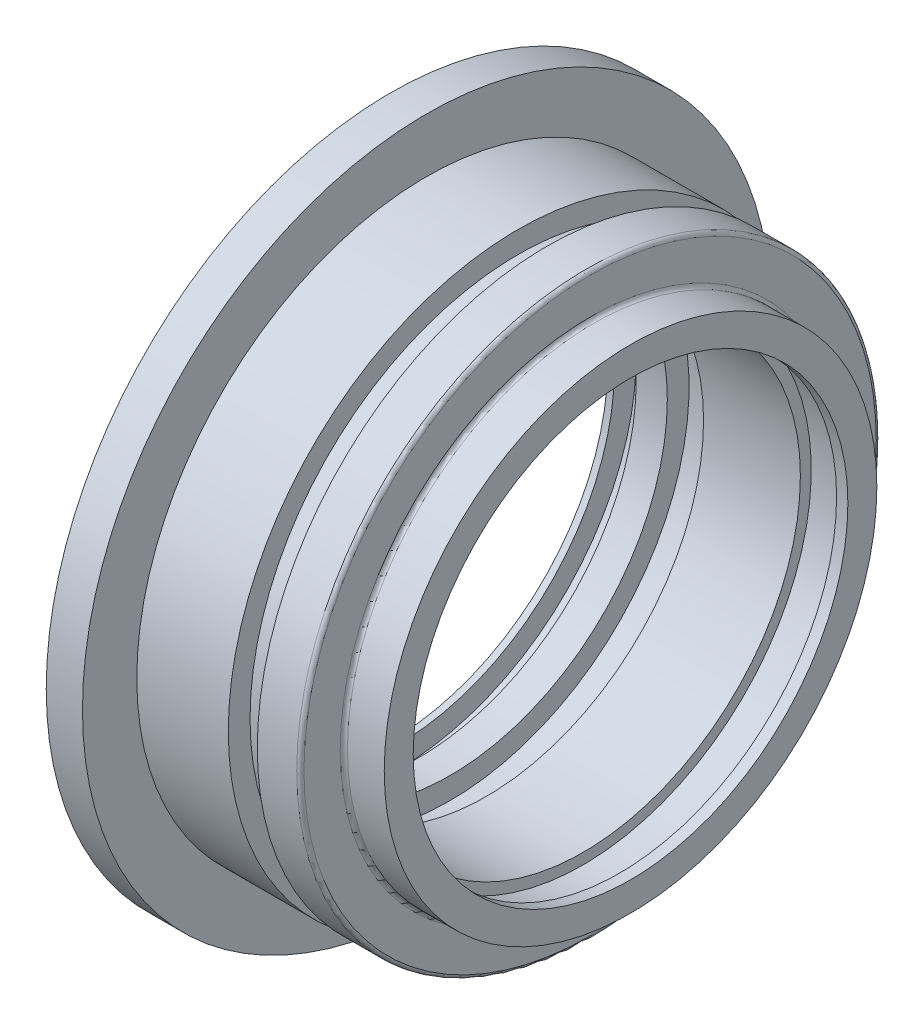
ISO-10303-21;
HEADER;
FILE_DESCRIPTION(('STEP AP214'),'2;1');
FILE_NAME('part.step','',(''),(''),'','','');
FILE_SCHEMA(('AUTOMOTIVE_DESIGN { 1 0 10303 214 1 1 1 1 }'));
ENDSEC;
DATA;
#1=APPLICATION_CONTEXT('core data for automotive mechanical design processes');
#2=APPLICATION_PROTOCOL_DEFINITION('international standard','automotive_design',2000,#1);
#3=PRODUCT_CONTEXT('',#1,'mechanical');
#4=PRODUCT('Part','Part','',(#3));
#5=PRODUCT_RELATED_PRODUCT_CATEGORY('part','',(#4));
#6=PRODUCT_DEFINITION_FORMATION('','',#4);
#7=PRODUCT_DEFINITION_CONTEXT('part definition',#1,'design');
#8=PRODUCT_DEFINITION('design','',#6,#7);
#9=PRODUCT_DEFINITION_SHAPE('','',#8);
#10=(LENGTH_UNIT() NAMED_UNIT(*) SI_UNIT(.MILLI.,.METRE.));
#11=(NAMED_UNIT(*) PLANE_ANGLE_UNIT() SI_UNIT($,.RADIAN.));
#12=(NAMED_UNIT(*) SI_UNIT($,.STERADIAN.) SOLID_ANGLE_UNIT());
#13=UNCERTAINTY_MEASURE_WITH_UNIT(LENGTH_MEASURE(1.E-05),#10,'distance_accuracy_value','');
#14=(GEOMETRIC_REPRESENTATION_CONTEXT(3) GLOBAL_UNCERTAINTY_ASSIGNED_CONTEXT((#13)) GLOBAL_UNIT_ASSIGNED_CONTEXT((#10,
#11,#12)) REPRESENTATION_CONTEXT('',''));
#15=CARTESIAN_POINT('',(0.,0.,0.));
#16=DIRECTION('',(0.,0.,1.));
#17=DIRECTION('',(1.,0.,0.));
#18=AXIS2_PLACEMENT_3D('',#15,#16,#17);
#19=CARTESIAN_POINT('',(-70.6647002893115,-47.5,0.));
#20=DIRECTION('',(-1.,0.,0.));
#21=DIRECTION('',(0.,0.,1.));
#22=AXIS2_PLACEMENT_3D('',#19,#20,#21);
#23=PLANE('',#22);
#24=CARTESIAN_POINT('',(-70.6647002893115,0.,0.));
#25=DIRECTION('',(-1.,0.,0.));
#26=DIRECTION('',(0.,0.,1.));
#27=AXIS2_PLACEMENT_3D('',#24,#25,#26);
#28=CIRCLE('',#27,47.5);
#29=CARTESIAN_POINT('',(-70.6647002893115,0.,47.5));
#30=VERTEX_POINT('',#29);
#31=EDGE_CURVE('E10',#30,#30,#28,.T.);
#32=ORIENTED_EDGE('',*,*,#31,.T.);
#33=EDGE_LOOP('',(#32));
#34=FACE_BOUND('',#33,.T.);
#35=CARTESIAN_POINT('',(-70.6647002893115,0.,0.));
#36=DIRECTION('',(-1.,0.,0.));
#37=DIRECTION('',(0.,0.,1.));
#38=AXIS2_PLACEMENT_3D('',#35,#36,#37);
#39=CIRCLE('',#38,30.);
#40=CARTESIAN_POINT('',(-70.6647002893115,0.,30.));
#41=VERTEX_POINT('',#40);
#42=EDGE_CURVE('E114',#41,#41,#39,.T.);
#43=ORIENTED_EDGE('',*,*,#42,.F.);
#44=EDGE_LOOP('',(#43));
#45=FACE_BOUND('',#44,.T.);
#46=ADVANCED_FACE('F32',(#34,#45),#23,.T.);
#47=CARTESIAN_POINT('',(-81.57816751546,0.,0.));
#48=DIRECTION('',(-1.,0.,0.));
#49=DIRECTION('',(0.,0.,1.));
#50=AXIS2_PLACEMENT_3D('',#47,#48,#49);
#51=CYLINDRICAL_SURFACE('',#50,47.5);
#52=CARTESIAN_POINT('',(-65.6647002893115,0.,0.));
#53=DIRECTION('',(-1.,0.,0.));
#54=DIRECTION('',(0.,0.,1.));
#55=AXIS2_PLACEMENT_3D('',#52,#53,#54);
#56=CIRCLE('',#55,47.5);
#57=CARTESIAN_POINT('',(-65.6647002893115,0.,47.5));
#58=VERTEX_POINT('',#57);
#59=EDGE_CURVE('E38',#58,#58,#56,.T.);
#60=ORIENTED_EDGE('',*,*,#59,.T.);
#61=EDGE_LOOP('',(#60));
#62=FACE_BOUND('',#61,.T.);
#63=ORIENTED_EDGE('',*,*,#31,.F.);
#64=EDGE_LOOP('',(#63));
#65=FACE_BOUND('',#64,.T.);
#66=ADVANCED_FACE('F122',(#62,#65),#51,.T.);
#67=CARTESIAN_POINT('',(-65.6647002893115,-47.5,0.));
#68=DIRECTION('',(1.,0.,0.));
#69=DIRECTION('',(0.,0.,-1.));
#70=AXIS2_PLACEMENT_3D('',#67,#68,#69);
#71=PLANE('',#70);
#72=CARTESIAN_POINT('',(-65.6647002893115,0.,0.));
#73=DIRECTION('',(-1.,0.,0.));
#74=DIRECTION('',(0.,0.,1.));
#75=AXIS2_PLACEMENT_3D('',#72,#73,#74);
#76=CIRCLE('',#75,40.);
#77=CARTESIAN_POINT('',(-65.6647002893115,0.,40.));
#78=VERTEX_POINT('',#77);
#79=EDGE_CURVE('E42',#78,#78,#76,.T.);
#80=ORIENTED_EDGE('',*,*,#79,.T.);
#81=EDGE_LOOP('',(#80));
#82=FACE_BOUND('',#81,.T.);
#83=ORIENTED_EDGE('',*,*,#59,.F.);
#84=EDGE_LOOP('',(#83));
#85=FACE_BOUND('',#84,.T.);
#86=ADVANCED_FACE('F126',(#82,#85),#71,.T.);
#87=CARTESIAN_POINT('',(-81.57816751546,0.,0.));
#88=DIRECTION('',(-1.,0.,0.));
#89=DIRECTION('',(0.,0.,1.));
#90=AXIS2_PLACEMENT_3D('',#87,#88,#89);
#91=CYLINDRICAL_SURFACE('',#90,40.);
#92=CARTESIAN_POINT('',(-53.0332155222467,0.,0.));
#93=DIRECTION('',(-1.,0.,0.));
#94=DIRECTION('',(0.,0.,1.));
#95=AXIS2_PLACEMENT_3D('',#92,#93,#94);
#96=CIRCLE('',#95,40.);
#97=CARTESIAN_POINT('',(-53.0332155222467,0.,40.));
#98=VERTEX_POINT('',#97);
#99=EDGE_CURVE('E46',#98,#98,#96,.T.);
#100=ORIENTED_EDGE('',*,*,#99,.T.);
#101=EDGE_LOOP('',(#100));
#102=FACE_BOUND('',#101,.T.);
#103=ORIENTED_EDGE('',*,*,#79,.F.);
#104=EDGE_LOOP('',(#103));
#105=FACE_BOUND('',#104,.T.);
#106=ADVANCED_FACE('F130',(#102,#105),#91,.T.);
#107=CARTESIAN_POINT('',(-53.0332155222467,-40.,0.));
#108=DIRECTION('',(1.,0.,0.));
#109=DIRECTION('',(0.,0.,-1.));
#110=AXIS2_PLACEMENT_3D('',#107,#108,#109);
#111=PLANE('',#110);
#112=CARTESIAN_POINT('',(-53.0332155222467,0.,0.));
#113=DIRECTION('',(-1.,0.,0.));
#114=DIRECTION('',(0.,0.,1.));
#115=AXIS2_PLACEMENT_3D('',#112,#113,#114);
#116=CIRCLE('',#115,37.);
#117=CARTESIAN_POINT('',(-53.0332155222467,0.,37.));
#118=VERTEX_POINT('',#117);
#119=EDGE_CURVE('E51',#118,#118,#116,.T.);
#120=ORIENTED_EDGE('',*,*,#119,.T.);
#121=EDGE_LOOP('',(#120));
#122=FACE_BOUND('',#121,.T.);
#123=ORIENTED_EDGE('',*,*,#99,.F.);
#124=EDGE_LOOP('',(#123));
#125=FACE_BOUND('',#124,.T.);
#126=ADVANCED_FACE('F137',(#122,#125),#111,.T.);
#127=CARTESIAN_POINT('',(-81.57816751546,0.,0.));
#128=DIRECTION('',(-1.,0.,0.));
#129=DIRECTION('',(0.,0.,1.));
#130=AXIS2_PLACEMENT_3D('',#127,#128,#129);
#131=CYLINDRICAL_SURFACE('',#130,37.);
#132=CARTESIAN_POINT('',(-49.0332155222467,0.,0.));
#133=DIRECTION('',(-1.,0.,0.));
#134=DIRECTION('',(0.,0.,1.));
#135=AXIS2_PLACEMENT_3D('',#132,#133,#134);
#136=CIRCLE('',#135,37.);
#137=CARTESIAN_POINT('',(-49.0332155222467,0.,37.));
#138=VERTEX_POINT('',#137);
#139=EDGE_CURVE('E54',#138,#138,#136,.T.);
#140=ORIENTED_EDGE('',*,*,#139,.T.);
#141=EDGE_LOOP('',(#140));
#142=FACE_BOUND('',#141,.T.);
#143=ORIENTED_EDGE('',*,*,#119,.F.);
#144=EDGE_LOOP('',(#143));
#145=FACE_BOUND('',#144,.T.);
#146=ADVANCED_FACE('F141',(#142,#145),#131,.T.);
#147=CARTESIAN_POINT('',(-49.0332155222467,-37.,0.));
#148=DIRECTION('',(-1.,0.,0.));
#149=DIRECTION('',(0.,0.,1.));
#150=AXIS2_PLACEMENT_3D('',#147,#148,#149);
#151=PLANE('',#150);
#152=CARTESIAN_POINT('',(-49.0332155222467,0.,0.));
#153=DIRECTION('',(-1.,0.,0.));
#154=DIRECTION('',(0.,0.,1.));
#155=AXIS2_PLACEMENT_3D('',#152,#153,#154);
#156=CIRCLE('',#155,40.);
#157=CARTESIAN_POINT('',(-49.0332155222467,0.,40.));
#158=VERTEX_POINT('',#157);
#159=EDGE_CURVE('E57',#158,#158,#156,.T.);
#160=ORIENTED_EDGE('',*,*,#159,.T.);
#161=EDGE_LOOP('',(#160));
#162=FACE_BOUND('',#161,.T.);
#163=ORIENTED_EDGE('',*,*,#139,.F.);
#164=EDGE_LOOP('',(#163));
#165=FACE_BOUND('',#164,.T.);
#166=ADVANCED_FACE('F145',(#162,#165),#151,.T.);
#167=CARTESIAN_POINT('',(-81.57816751546,0.,0.));
#168=DIRECTION('',(-1.,0.,0.));
#169=DIRECTION('',(0.,0.,1.));
#170=AXIS2_PLACEMENT_3D('',#167,#168,#169);
#171=CYLINDRICAL_SURFACE('',#170,40.);
#172=CARTESIAN_POINT('',(-43.5880588984075,0.,0.));
#173=DIRECTION('',(-1.,0.,0.));
#174=DIRECTION('',(0.,0.,1.));
#175=AXIS2_PLACEMENT_3D('',#172,#173,#174);
#176=CIRCLE('',#175,40.);
#177=CARTESIAN_POINT('',(-43.5880588984075,0.,40.));
#178=VERTEX_POINT('',#177);
#179=EDGE_CURVE('E60',#178,#178,#176,.T.);
#180=ORIENTED_EDGE('',*,*,#179,.T.);
#181=EDGE_LOOP('',(#180));
#182=FACE_BOUND('',#181,.T.);
#183=ORIENTED_EDGE('',*,*,#159,.F.);
#184=EDGE_LOOP('',(#183));
#185=FACE_BOUND('',#184,.T.);
#186=ADVANCED_FACE('F149',(#182,#185),#171,.T.);
#187=CARTESIAN_POINT('',(-43.5880588984075,0.,0.));
#188=DIRECTION('',(-1.,0.,0.));
#189=DIRECTION('',(0.,0.,1.));
#190=AXIS2_PLACEMENT_3D('',#187,#188,#189);
#191=TOROIDAL_SURFACE('',#190,39.5,0.5);
#192=CARTESIAN_POINT('',(-43.0880588984075,0.,0.));
#193=DIRECTION('',(-1.,0.,0.));
#194=DIRECTION('',(0.,0.,1.));
#195=AXIS2_PLACEMENT_3D('',#192,#193,#194);
#196=CIRCLE('',#195,39.5);
#197=CARTESIAN_POINT('',(-43.0880588984075,0.,39.5));
#198=VERTEX_POINT('',#197);
#199=EDGE_CURVE('E63',#198,#198,#196,.T.);
#200=ORIENTED_EDGE('',*,*,#199,.T.);
#201=EDGE_LOOP('',(#200));
#202=FACE_BOUND('',#201,.T.);
#203=ORIENTED_EDGE('',*,*,#179,.F.);
#204=EDGE_LOOP('',(#203));
#205=FACE_BOUND('',#204,.T.);
#206=ADVANCED_FACE('F153',(#202,#205),#191,.T.);
#207=CARTESIAN_POINT('',(-43.0880588984075,-34.4999999999999,0.));
#208=DIRECTION('',(1.,0.,0.));
#209=DIRECTION('',(0.,0.,-1.));
#210=AXIS2_PLACEMENT_3D('',#207,#208,#209);
#211=PLANE('',#210);
#212=CARTESIAN_POINT('',(-43.0880588984075,0.,0.));
#213=DIRECTION('',(-1.,0.,0.));
#214=DIRECTION('',(0.,0.,1.));
#215=AXIS2_PLACEMENT_3D('',#212,#213,#214);
#216=CIRCLE('',#215,34.4999999999999);
#217=CARTESIAN_POINT('',(-43.0880588984075,0.,34.4999999999999));
#218=VERTEX_POINT('',#217);
#219=EDGE_CURVE('E66',#218,#218,#216,.T.);
#220=ORIENTED_EDGE('',*,*,#219,.T.);
#221=EDGE_LOOP('',(#220));
#222=FACE_BOUND('',#221,.T.);
#223=ORIENTED_EDGE('',*,*,#199,.F.);
#224=EDGE_LOOP('',(#223));
#225=FACE_BOUND('',#224,.T.);
#226=ADVANCED_FACE('F157',(#222,#225),#211,.T.);
#227=CARTESIAN_POINT('',(-42.5880588984075,0.,0.));
#228=DIRECTION('',(-1.,0.,0.));
#229=DIRECTION('',(0.,0.,1.));
#230=AXIS2_PLACEMENT_3D('',#227,#228,#229);
#231=TOROIDAL_SURFACE('',#230,34.4999999999999,0.5);
#232=CARTESIAN_POINT('',(-42.5880588984075,0.,0.));
#233=DIRECTION('',(-1.,0.,0.));
#234=DIRECTION('',(0.,0.,1.));
#235=AXIS2_PLACEMENT_3D('',#232,#233,#234);
#236=CIRCLE('',#235,33.9999999999999);
#237=CARTESIAN_POINT('',(-42.5880588984075,0.,33.9999999999999));
#238=VERTEX_POINT('',#237);
#239=EDGE_CURVE('E69',#238,#238,#236,.T.);
#240=ORIENTED_EDGE('',*,*,#239,.T.);
#241=EDGE_LOOP('',(#240));
#242=FACE_BOUND('',#241,.T.);
#243=ORIENTED_EDGE('',*,*,#219,.F.);
#244=EDGE_LOOP('',(#243));
#245=FACE_BOUND('',#244,.T.);
#246=ADVANCED_FACE('F161',(#242,#245),#231,.F.);
#247=CARTESIAN_POINT('',(-81.57816751546,0.,0.));
#248=DIRECTION('',(-1.,0.,0.));
#249=DIRECTION('',(0.,0.,1.));
#250=AXIS2_PLACEMENT_3D('',#247,#248,#249);
#251=CYLINDRICAL_SURFACE('',#250,33.9999999999999);
#252=CARTESIAN_POINT('',(-37.5082878795635,0.,0.));
#253=DIRECTION('',(-1.,0.,0.));
#254=DIRECTION('',(0.,0.,1.));
#255=AXIS2_PLACEMENT_3D('',#252,#253,#254);
#256=CIRCLE('',#255,33.9999999999999);
#257=CARTESIAN_POINT('',(-37.5082878795635,0.,33.9999999999999));
#258=VERTEX_POINT('',#257);
#259=EDGE_CURVE('E72',#258,#258,#256,.T.);
#260=ORIENTED_EDGE('',*,*,#259,.T.);
#261=EDGE_LOOP('',(#260));
#262=FACE_BOUND('',#261,.T.);
#263=ORIENTED_EDGE('',*,*,#239,.F.);
#264=EDGE_LOOP('',(#263));
#265=FACE_BOUND('',#264,.T.);
#266=ADVANCED_FACE('F165',(#262,#265),#251,.T.);
#267=CARTESIAN_POINT('',(-37.5082878795635,-30.,0.));
#268=DIRECTION('',(1.,0.,0.));
#269=DIRECTION('',(0.,0.,-1.));
#270=AXIS2_PLACEMENT_3D('',#267,#268,#269);
#271=PLANE('',#270);
#272=CARTESIAN_POINT('',(-37.5082878795635,0.,0.));
#273=DIRECTION('',(-1.,0.,0.));
#274=DIRECTION('',(0.,0.,1.));
#275=AXIS2_PLACEMENT_3D('',#272,#273,#274);
#276=CIRCLE('',#275,30.);
#277=CARTESIAN_POINT('',(-37.5082878795635,0.,30.));
#278=VERTEX_POINT('',#277);
#279=EDGE_CURVE('E75',#278,#278,#276,.T.);
#280=ORIENTED_EDGE('',*,*,#279,.T.);
#281=EDGE_LOOP('',(#280));
#282=FACE_BOUND('',#281,.T.);
#283=ORIENTED_EDGE('',*,*,#259,.F.);
#284=EDGE_LOOP('',(#283));
#285=FACE_BOUND('',#284,.T.);
#286=ADVANCED_FACE('F169',(#282,#285),#271,.T.);
#287=CARTESIAN_POINT('',(-81.57816751546,0.,0.));
#288=DIRECTION('',(-1.,0.,0.));
#289=DIRECTION('',(0.,0.,1.));
#290=AXIS2_PLACEMENT_3D('',#287,#288,#289);
#291=CYLINDRICAL_SURFACE('',#290,30.);
#292=CARTESIAN_POINT('',(-39.0643744089391,0.,0.));
#293=DIRECTION('',(-1.,0.,0.));
#294=DIRECTION('',(0.,0.,1.));
#295=AXIS2_PLACEMENT_3D('',#292,#293,#294);
#296=CIRCLE('',#295,30.);
#297=CARTESIAN_POINT('',(-39.0643744089391,0.,30.));
#298=VERTEX_POINT('',#297);
#299=EDGE_CURVE('E78',#298,#298,#296,.T.);
#300=ORIENTED_EDGE('',*,*,#299,.T.);
#301=EDGE_LOOP('',(#300));
#302=FACE_BOUND('',#301,.T.);
#303=ORIENTED_EDGE('',*,*,#279,.F.);
#304=EDGE_LOOP('',(#303));
#305=FACE_BOUND('',#304,.T.);
#306=ADVANCED_FACE('F173',(#302,#305),#291,.F.);
#307=CARTESIAN_POINT('',(-39.0643744089391,-31.5,0.));
#308=DIRECTION('',(-1.,0.,0.));
#309=DIRECTION('',(0.,0.,1.));
#310=AXIS2_PLACEMENT_3D('',#307,#308,#309);
#311=PLANE('',#310);
#312=CARTESIAN_POINT('',(-39.0643744089391,0.,0.));
#313=DIRECTION('',(-1.,0.,0.));
#314=DIRECTION('',(0.,0.,1.));
#315=AXIS2_PLACEMENT_3D('',#312,#313,#314);
#316=CIRCLE('',#315,31.5);
#317=CARTESIAN_POINT('',(-39.0643744089391,0.,31.5));
#318=VERTEX_POINT('',#317);
#319=EDGE_CURVE('E81',#318,#318,#316,.T.);
#320=ORIENTED_EDGE('',*,*,#319,.T.);
#321=EDGE_LOOP('',(#320));
#322=FACE_BOUND('',#321,.T.);
#323=ORIENTED_EDGE('',*,*,#299,.F.);
#324=EDGE_LOOP('',(#323));
#325=FACE_BOUND('',#324,.T.);
#326=ADVANCED_FACE('F177',(#322,#325),#311,.T.);
#327=CARTESIAN_POINT('',(-81.57816751546,0.,0.));
#328=DIRECTION('',(-1.,0.,0.));
#329=DIRECTION('',(0.,0.,1.));
#330=AXIS2_PLACEMENT_3D('',#327,#328,#329);
#331=CYLINDRICAL_SURFACE('',#330,31.5);
#332=CARTESIAN_POINT('',(-44.0643744089391,0.,0.));
#333=DIRECTION('',(-1.,0.,0.));
#334=DIRECTION('',(0.,0.,1.));
#335=AXIS2_PLACEMENT_3D('',#332,#333,#334);
#336=CIRCLE('',#335,31.5);
#337=CARTESIAN_POINT('',(-44.0643744089391,0.,31.5));
#338=VERTEX_POINT('',#337);
#339=EDGE_CURVE('E84',#338,#338,#336,.T.);
#340=ORIENTED_EDGE('',*,*,#339,.T.);
#341=EDGE_LOOP('',(#340));
#342=FACE_BOUND('',#341,.T.);
#343=ORIENTED_EDGE('',*,*,#319,.F.);
#344=EDGE_LOOP('',(#343));
#345=FACE_BOUND('',#344,.T.);
#346=ADVANCED_FACE('F181',(#342,#345),#331,.F.);
#347=CARTESIAN_POINT('',(-44.0643744089391,-30.,0.));
#348=DIRECTION('',(1.,0.,0.));
#349=DIRECTION('',(0.,0.,-1.));
#350=AXIS2_PLACEMENT_3D('',#347,#348,#349);
#351=PLANE('',#350);
#352=CARTESIAN_POINT('',(-44.0643744089391,0.,0.));
#353=DIRECTION('',(-1.,0.,0.));
#354=DIRECTION('',(0.,0.,1.));
#355=AXIS2_PLACEMENT_3D('',#352,#353,#354);
#356=CIRCLE('',#355,30.);
#357=CARTESIAN_POINT('',(-44.0643744089391,0.,30.));
#358=VERTEX_POINT('',#357);
#359=EDGE_CURVE('E87',#358,#358,#356,.T.);
#360=ORIENTED_EDGE('',*,*,#359,.T.);
#361=EDGE_LOOP('',(#360));
#362=FACE_BOUND('',#361,.T.);
#363=ORIENTED_EDGE('',*,*,#339,.F.);
#364=EDGE_LOOP('',(#363));
#365=FACE_BOUND('',#364,.T.);
#366=ADVANCED_FACE('F185',(#362,#365),#351,.T.);
#367=CARTESIAN_POINT('',(-81.57816751546,0.,0.));
#368=DIRECTION('',(-1.,0.,0.));
#369=DIRECTION('',(0.,0.,1.));
#370=AXIS2_PLACEMENT_3D('',#367,#368,#369);
#371=CYLINDRICAL_SURFACE('',#370,30.);
#372=CARTESIAN_POINT('',(-57.4290100656596,0.,0.));
#373=DIRECTION('',(-1.,0.,0.));
#374=DIRECTION('',(0.,0.,1.));
#375=AXIS2_PLACEMENT_3D('',#372,#373,#374);
#376=CIRCLE('',#375,30.);
#377=CARTESIAN_POINT('',(-57.4290100656596,0.,30.));
#378=VERTEX_POINT('',#377);
#379=EDGE_CURVE('E90',#378,#378,#376,.T.);
#380=ORIENTED_EDGE('',*,*,#379,.T.);
#381=EDGE_LOOP('',(#380));
#382=FACE_BOUND('',#381,.T.);
#383=ORIENTED_EDGE('',*,*,#359,.F.);
#384=EDGE_LOOP('',(#383));
#385=FACE_BOUND('',#384,.T.);
#386=ADVANCED_FACE('F189',(#382,#385),#371,.F.);
#387=CARTESIAN_POINT('',(-57.4290100656596,-33.,0.));
#388=DIRECTION('',(-1.,0.,0.));
#389=DIRECTION('',(0.,0.,1.));
#390=AXIS2_PLACEMENT_3D('',#387,#388,#389);
#391=PLANE('',#390);
#392=CARTESIAN_POINT('',(-57.4290100656596,0.,0.));
#393=DIRECTION('',(-1.,0.,0.));
#394=DIRECTION('',(0.,0.,1.));
#395=AXIS2_PLACEMENT_3D('',#392,#393,#394);
#396=CIRCLE('',#395,33.);
#397=CARTESIAN_POINT('',(-57.4290100656596,0.,33.));
#398=VERTEX_POINT('',#397);
#399=EDGE_CURVE('E93',#398,#398,#396,.T.);
#400=ORIENTED_EDGE('',*,*,#399,.T.);
#401=EDGE_LOOP('',(#400));
#402=FACE_BOUND('',#401,.T.);
#403=ORIENTED_EDGE('',*,*,#379,.F.);
#404=EDGE_LOOP('',(#403));
#405=FACE_BOUND('',#404,.T.);
#406=ADVANCED_FACE('F193',(#402,#405),#391,.T.);
#407=CARTESIAN_POINT('',(-81.57816751546,0.,0.));
#408=DIRECTION('',(-1.,0.,0.));
#409=DIRECTION('',(0.,0.,1.));
#410=AXIS2_PLACEMENT_3D('',#407,#408,#409);
#411=CYLINDRICAL_SURFACE('',#410,33.);
#412=CARTESIAN_POINT('',(-62.4290100656596,0.,0.));
#413=DIRECTION('',(-1.,0.,0.));
#414=DIRECTION('',(0.,0.,1.));
#415=AXIS2_PLACEMENT_3D('',#412,#413,#414);
#416=CIRCLE('',#415,33.);
#417=CARTESIAN_POINT('',(-62.4290100656596,0.,33.));
#418=VERTEX_POINT('',#417);
#419=EDGE_CURVE('E96',#418,#418,#416,.T.);
#420=ORIENTED_EDGE('',*,*,#419,.T.);
#421=EDGE_LOOP('',(#420));
#422=FACE_BOUND('',#421,.T.);
#423=ORIENTED_EDGE('',*,*,#399,.F.);
#424=EDGE_LOOP('',(#423));
#425=FACE_BOUND('',#424,.T.);
#426=ADVANCED_FACE('F197',(#422,#425),#411,.F.);
#427=CARTESIAN_POINT('',(-62.4290100656596,-30.,0.));
#428=DIRECTION('',(1.,0.,0.));
#429=DIRECTION('',(0.,0.,-1.));
#430=AXIS2_PLACEMENT_3D('',#427,#428,#429);
#431=PLANE('',#430);
#432=CARTESIAN_POINT('',(-62.4290100656596,0.,0.));
#433=DIRECTION('',(-1.,0.,0.));
#434=DIRECTION('',(0.,0.,1.));
#435=AXIS2_PLACEMENT_3D('',#432,#433,#434);
#436=CIRCLE('',#435,30.);
#437=CARTESIAN_POINT('',(-62.4290100656596,0.,30.));
#438=VERTEX_POINT('',#437);
#439=EDGE_CURVE('E99',#438,#438,#436,.T.);
#440=ORIENTED_EDGE('',*,*,#439,.T.);
#441=EDGE_LOOP('',(#440));
#442=FACE_BOUND('',#441,.T.);
#443=ORIENTED_EDGE('',*,*,#419,.F.);
#444=EDGE_LOOP('',(#443));
#445=FACE_BOUND('',#444,.T.);
#446=ADVANCED_FACE('F201',(#442,#445),#431,.T.);
#447=CARTESIAN_POINT('',(-81.57816751546,0.,0.));
#448=DIRECTION('',(-1.,0.,0.));
#449=DIRECTION('',(0.,0.,1.));
#450=AXIS2_PLACEMENT_3D('',#447,#448,#449);
#451=CYLINDRICAL_SURFACE('',#450,30.);
#452=CARTESIAN_POINT('',(-66.7250822530633,0.,0.));
#453=DIRECTION('',(-1.,0.,0.));
#454=DIRECTION('',(0.,0.,1.));
#455=AXIS2_PLACEMENT_3D('',#452,#453,#454);
#456=CIRCLE('',#455,30.);
#457=CARTESIAN_POINT('',(-66.7250822530633,0.,30.));
#458=VERTEX_POINT('',#457);
#459=EDGE_CURVE('E102',#458,#458,#456,.T.);
#460=ORIENTED_EDGE('',*,*,#459,.T.);
#461=EDGE_LOOP('',(#460));
#462=FACE_BOUND('',#461,.T.);
#463=ORIENTED_EDGE('',*,*,#439,.F.);
#464=EDGE_LOOP('',(#463));
#465=FACE_BOUND('',#464,.T.);
#466=ADVANCED_FACE('F205',(#462,#465),#451,.F.);
#467=CARTESIAN_POINT('',(-66.7250822530633,-33.,0.));
#468=DIRECTION('',(-1.,0.,0.));
#469=DIRECTION('',(0.,0.,1.));
#470=AXIS2_PLACEMENT_3D('',#467,#468,#469);
#471=PLANE('',#470);
#472=CARTESIAN_POINT('',(-66.7250822530633,0.,0.));
#473=DIRECTION('',(-1.,0.,0.));
#474=DIRECTION('',(0.,0.,1.));
#475=AXIS2_PLACEMENT_3D('',#472,#473,#474);
#476=CIRCLE('',#475,33.);
#477=CARTESIAN_POINT('',(-66.7250822530633,0.,33.));
#478=VERTEX_POINT('',#477);
#479=EDGE_CURVE('E105',#478,#478,#476,.T.);
#480=ORIENTED_EDGE('',*,*,#479,.T.);
#481=EDGE_LOOP('',(#480));
#482=FACE_BOUND('',#481,.T.);
#483=ORIENTED_EDGE('',*,*,#459,.F.);
#484=EDGE_LOOP('',(#483));
#485=FACE_BOUND('',#484,.T.);
#486=ADVANCED_FACE('F209',(#482,#485),#471,.T.);
#487=CARTESIAN_POINT('',(-81.57816751546,0.,0.));
#488=DIRECTION('',(-1.,0.,0.));
#489=DIRECTION('',(0.,0.,1.));
#490=AXIS2_PLACEMENT_3D('',#487,#488,#489);
#491=CYLINDRICAL_SURFACE('',#490,33.);
#492=CARTESIAN_POINT('',(-69.7250822530633,0.,0.));
#493=DIRECTION('',(-1.,0.,0.));
#494=DIRECTION('',(0.,0.,1.));
#495=AXIS2_PLACEMENT_3D('',#492,#493,#494);
#496=CIRCLE('',#495,33.);
#497=CARTESIAN_POINT('',(-69.7250822530633,0.,33.));
#498=VERTEX_POINT('',#497);
#499=EDGE_CURVE('E108',#498,#498,#496,.T.);
#500=ORIENTED_EDGE('',*,*,#499,.T.);
#501=EDGE_LOOP('',(#500));
#502=FACE_BOUND('',#501,.T.);
#503=ORIENTED_EDGE('',*,*,#479,.F.);
#504=EDGE_LOOP('',(#503));
#505=FACE_BOUND('',#504,.T.);
#506=ADVANCED_FACE('F213',(#502,#505),#491,.F.);
#507=CARTESIAN_POINT('',(-69.7250822530633,-30.,0.));
#508=DIRECTION('',(1.,0.,0.));
#509=DIRECTION('',(0.,0.,-1.));
#510=AXIS2_PLACEMENT_3D('',#507,#508,#509);
#511=PLANE('',#510);
#512=CARTESIAN_POINT('',(-69.7250822530633,0.,0.));
#513=DIRECTION('',(-1.,0.,0.));
#514=DIRECTION('',(0.,0.,1.));
#515=AXIS2_PLACEMENT_3D('',#512,#513,#514);
#516=CIRCLE('',#515,30.);
#517=CARTESIAN_POINT('',(-69.7250822530633,0.,30.));
#518=VERTEX_POINT('',#517);
#519=EDGE_CURVE('E111',#518,#518,#516,.T.);
#520=ORIENTED_EDGE('',*,*,#519,.T.);
#521=EDGE_LOOP('',(#520));
#522=FACE_BOUND('',#521,.T.);
#523=ORIENTED_EDGE('',*,*,#499,.F.);
#524=EDGE_LOOP('',(#523));
#525=FACE_BOUND('',#524,.T.);
#526=ADVANCED_FACE('F217',(#522,#525),#511,.T.);
#527=CARTESIAN_POINT('',(-81.57816751546,0.,0.));
#528=DIRECTION('',(-1.,0.,0.));
#529=DIRECTION('',(0.,0.,1.));
#530=AXIS2_PLACEMENT_3D('',#527,#528,#529);
#531=CYLINDRICAL_SURFACE('',#530,30.);
#532=ORIENTED_EDGE('',*,*,#42,.T.);
#533=EDGE_LOOP('',(#532));
#534=FACE_BOUND('',#533,.T.);
#535=ORIENTED_EDGE('',*,*,#519,.F.);
#536=EDGE_LOOP('',(#535));
#537=FACE_BOUND('',#536,.T.);
#538=ADVANCED_FACE('F118',(#534,#537),#531,.F.);
#539=CLOSED_SHELL('',(#46,#66,#86,#106,#126,#146,#166,#186,#206,#226,#246,#266,#286,#306,#326,
#346,#366,#386,#406,#426,#446,#466,#486,#506,#526,#538));
#540=MANIFOLD_SOLID_BREP('B2',#539);
#541=ADVANCED_BREP_SHAPE_REPRESENTATION('',(#18,#540),#14);
#542=SHAPE_DEFINITION_REPRESENTATION(#9,#541);
ENDSEC;
END-ISO-10303-21;
